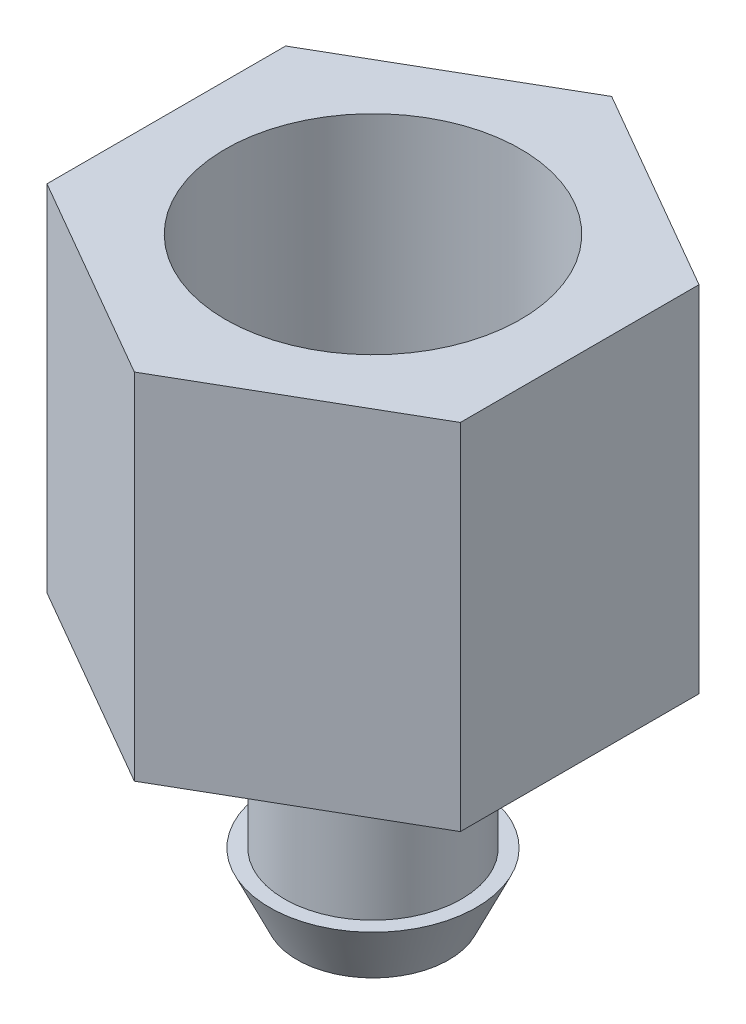
ISO-10303-21;
HEADER;
FILE_DESCRIPTION(('STEP AP214'),'2;1');
FILE_NAME('part.step','',(''),(''),'','','');
FILE_SCHEMA(('AUTOMOTIVE_DESIGN { 1 0 10303 214 1 1 1 1 }'));
ENDSEC;
DATA;
#1=APPLICATION_CONTEXT('core data for automotive mechanical design processes');
#2=APPLICATION_PROTOCOL_DEFINITION('international standard','automotive_design',2000,#1);
#3=PRODUCT_CONTEXT('',#1,'mechanical');
#4=PRODUCT('Part','Part','',(#3));
#5=PRODUCT_RELATED_PRODUCT_CATEGORY('part','',(#4));
#6=PRODUCT_DEFINITION_FORMATION('','',#4);
#7=PRODUCT_DEFINITION_CONTEXT('part definition',#1,'design');
#8=PRODUCT_DEFINITION('design','',#6,#7);
#9=PRODUCT_DEFINITION_SHAPE('','',#8);
#10=(LENGTH_UNIT() NAMED_UNIT(*) SI_UNIT(.MILLI.,.METRE.));
#11=(NAMED_UNIT(*) PLANE_ANGLE_UNIT() SI_UNIT($,.RADIAN.));
#12=(NAMED_UNIT(*) SI_UNIT($,.STERADIAN.) SOLID_ANGLE_UNIT());
#13=UNCERTAINTY_MEASURE_WITH_UNIT(LENGTH_MEASURE(1.E-05),#10,'distance_accuracy_value','');
#14=(GEOMETRIC_REPRESENTATION_CONTEXT(3) GLOBAL_UNCERTAINTY_ASSIGNED_CONTEXT((#13)) GLOBAL_UNIT_ASSIGNED_CONTEXT((#10,
#11,#12)) REPRESENTATION_CONTEXT('',''));
#15=CARTESIAN_POINT('',(0.,0.,0.));
#16=DIRECTION('',(0.,0.,1.));
#17=DIRECTION('',(1.,0.,0.));
#18=AXIS2_PLACEMENT_3D('',#15,#16,#17);
#19=CARTESIAN_POINT('',(0.,0.,-8.08290376865475));
#20=DIRECTION('',(0.,1.,0.));
#21=DIRECTION('',(0.,0.,1.));
#22=AXIS2_PLACEMENT_3D('',#19,#20,#21);
#23=PLANE('',#22);
#24=DIRECTION('',(-0.866025403784439,0.,-0.5));
#25=VECTOR('',#24,1.);
#26=CARTESIAN_POINT('',(6.99999999999998,0.,-4.04145188432738));
#27=LINE('',#26,#25);
#28=CARTESIAN_POINT('',(6.99999999999998,0.,-4.04145188432738));
#29=VERTEX_POINT('',#28);
#30=CARTESIAN_POINT('',(0.,0.,-8.08290376865475));
#31=VERTEX_POINT('',#30);
#32=EDGE_CURVE('E117',#29,#31,#27,.T.);
#33=ORIENTED_EDGE('',*,*,#32,.F.);
#34=DIRECTION('',(0.,0.,-1.));
#35=VECTOR('',#34,1.);
#36=CARTESIAN_POINT('',(6.99999999999998,0.,4.04145188432741));
#37=LINE('',#36,#35);
#38=CARTESIAN_POINT('',(6.99999999999998,0.,4.04145188432741));
#39=VERTEX_POINT('',#38);
#40=EDGE_CURVE('E77',#39,#29,#37,.T.);
#41=ORIENTED_EDGE('',*,*,#40,.F.);
#42=DIRECTION('',(0.866025403784439,0.,-0.5));
#43=VECTOR('',#42,1.);
#44=CARTESIAN_POINT('',(0.,0.,8.08290376865478));
#45=LINE('',#44,#43);
#46=CARTESIAN_POINT('',(0.,0.,8.08290376865478));
#47=VERTEX_POINT('',#46);
#48=EDGE_CURVE('E71',#47,#39,#45,.T.);
#49=ORIENTED_EDGE('',*,*,#48,.F.);
#50=DIRECTION('',(0.866025403784439,0.,0.5));
#51=VECTOR('',#50,1.);
#52=CARTESIAN_POINT('',(-7.00000000000001,0.,4.0414518843274));
#53=LINE('',#52,#51);
#54=CARTESIAN_POINT('',(-7.00000000000001,0.,4.0414518843274));
#55=VERTEX_POINT('',#54);
#56=EDGE_CURVE('E107',#55,#47,#53,.T.);
#57=ORIENTED_EDGE('',*,*,#56,.F.);
#58=DIRECTION('',(0.,0.,1.));
#59=VECTOR('',#58,1.);
#60=CARTESIAN_POINT('',(-7.00000000000001,0.,-4.04145188432736));
#61=LINE('',#60,#59);
#62=CARTESIAN_POINT('',(-7.00000000000001,0.,-4.04145188432736));
#63=VERTEX_POINT('',#62);
#64=EDGE_CURVE('E123',#63,#55,#61,.T.);
#65=ORIENTED_EDGE('',*,*,#64,.F.);
#66=DIRECTION('',(-0.866025403784439,0.,0.5));
#67=VECTOR('',#66,1.);
#68=CARTESIAN_POINT('',(0.,0.,-8.08290376865475));
#69=LINE('',#68,#67);
#70=EDGE_CURVE('E120',#31,#63,#69,.T.);
#71=ORIENTED_EDGE('',*,*,#70,.F.);
#72=EDGE_LOOP('',(#33,#41,#49,#57,#65,#71));
#73=FACE_BOUND('',#72,.T.);
#74=CARTESIAN_POINT('',(0.,0.,0.));
#75=DIRECTION('',(0.,1.,0.));
#76=DIRECTION('',(0.,0.,1.));
#77=AXIS2_PLACEMENT_3D('',#74,#75,#76);
#78=CIRCLE('',#77,3.);
#79=CARTESIAN_POINT('',(0.,0.,3.));
#80=VERTEX_POINT('',#79);
#81=EDGE_CURVE('E40',#80,#80,#78,.F.);
#82=ORIENTED_EDGE('',*,*,#81,.F.);
#83=EDGE_LOOP('',(#82));
#84=FACE_BOUND('',#83,.T.);
#85=ADVANCED_FACE('F31',(#73,#84),#23,.F.);
#86=CARTESIAN_POINT('',(6.99999999999998,12.,-4.04145188432738));
#87=DIRECTION('',(-0.5,0.,0.866025403784439));
#88=DIRECTION('',(0.866025403784439,0.,0.5));
#89=AXIS2_PLACEMENT_3D('',#86,#87,#88);
#90=PLANE('',#89);
#91=ORIENTED_EDGE('',*,*,#32,.T.);
#92=DIRECTION('',(0.,-1.,0.));
#93=VECTOR('',#92,1.);
#94=CARTESIAN_POINT('',(0.,12.,-8.08290376865475));
#95=LINE('',#94,#93);
#96=CARTESIAN_POINT('',(0.,12.,-8.08290376865475));
#97=VERTEX_POINT('',#96);
#98=EDGE_CURVE('E135',#97,#31,#95,.T.);
#99=ORIENTED_EDGE('',*,*,#98,.F.);
#100=DIRECTION('',(-0.866025403784439,0.,-0.5));
#101=VECTOR('',#100,1.);
#102=CARTESIAN_POINT('',(6.99999999999998,12.,-4.04145188432738));
#103=LINE('',#102,#101);
#104=CARTESIAN_POINT('',(6.99999999999998,12.,-4.04145188432738));
#105=VERTEX_POINT('',#104);
#106=EDGE_CURVE('E128',#105,#97,#103,.T.);
#107=ORIENTED_EDGE('',*,*,#106,.F.);
#108=DIRECTION('',(0.,-1.,0.));
#109=VECTOR('',#108,1.);
#110=CARTESIAN_POINT('',(6.99999999999998,12.,-4.04145188432738));
#111=LINE('',#110,#109);
#112=EDGE_CURVE('E113',#105,#29,#111,.T.);
#113=ORIENTED_EDGE('',*,*,#112,.T.);
#114=EDGE_LOOP('',(#91,#99,#107,#113));
#115=FACE_BOUND('',#114,.T.);
#116=ADVANCED_FACE('F142',(#115),#90,.F.);
#117=CARTESIAN_POINT('',(0.,12.,-8.08290376865475));
#118=DIRECTION('',(0.5,0.,0.866025403784439));
#119=DIRECTION('',(0.866025403784439,0.,-0.5));
#120=AXIS2_PLACEMENT_3D('',#117,#118,#119);
#121=PLANE('',#120);
#122=ORIENTED_EDGE('',*,*,#70,.T.);
#123=DIRECTION('',(0.,-1.,0.));
#124=VECTOR('',#123,1.);
#125=CARTESIAN_POINT('',(-7.00000000000001,12.,-4.04145188432736));
#126=LINE('',#125,#124);
#127=CARTESIAN_POINT('',(-7.00000000000001,12.,-4.04145188432736));
#128=VERTEX_POINT('',#127);
#129=EDGE_CURVE('E132',#128,#63,#126,.T.);
#130=ORIENTED_EDGE('',*,*,#129,.F.);
#131=DIRECTION('',(-0.866025403784439,0.,0.5));
#132=VECTOR('',#131,1.);
#133=CARTESIAN_POINT('',(0.,12.,-8.08290376865475));
#134=LINE('',#133,#132);
#135=EDGE_CURVE('E86',#97,#128,#134,.T.);
#136=ORIENTED_EDGE('',*,*,#135,.F.);
#137=ORIENTED_EDGE('',*,*,#98,.T.);
#138=EDGE_LOOP('',(#122,#130,#136,#137));
#139=FACE_BOUND('',#138,.T.);
#140=ADVANCED_FACE('F148',(#139),#121,.F.);
#141=CARTESIAN_POINT('',(-7.00000000000001,12.,-4.04145188432736));
#142=DIRECTION('',(1.,0.,0.));
#143=DIRECTION('',(0.,0.,-1.));
#144=AXIS2_PLACEMENT_3D('',#141,#142,#143);
#145=PLANE('',#144);
#146=ORIENTED_EDGE('',*,*,#64,.T.);
#147=DIRECTION('',(0.,-1.,0.));
#148=VECTOR('',#147,1.);
#149=CARTESIAN_POINT('',(-7.00000000000001,12.,4.0414518843274));
#150=LINE('',#149,#148);
#151=CARTESIAN_POINT('',(-7.00000000000001,12.,4.0414518843274));
#152=VERTEX_POINT('',#151);
#153=EDGE_CURVE('E108',#152,#55,#150,.T.);
#154=ORIENTED_EDGE('',*,*,#153,.F.);
#155=DIRECTION('',(0.,0.,1.));
#156=VECTOR('',#155,1.);
#157=CARTESIAN_POINT('',(-7.00000000000001,12.,-4.04145188432736));
#158=LINE('',#157,#156);
#159=EDGE_CURVE('E99',#128,#152,#158,.T.);
#160=ORIENTED_EDGE('',*,*,#159,.F.);
#161=ORIENTED_EDGE('',*,*,#129,.T.);
#162=EDGE_LOOP('',(#146,#154,#160,#161));
#163=FACE_BOUND('',#162,.T.);
#164=ADVANCED_FACE('F161',(#163),#145,.F.);
#165=CARTESIAN_POINT('',(-7.00000000000001,12.,4.0414518843274));
#166=DIRECTION('',(0.5,0.,-0.866025403784439));
#167=DIRECTION('',(-0.866025403784439,0.,-0.5));
#168=AXIS2_PLACEMENT_3D('',#165,#166,#167);
#169=PLANE('',#168);
#170=ORIENTED_EDGE('',*,*,#56,.T.);
#171=DIRECTION('',(0.,-1.,0.));
#172=VECTOR('',#171,1.);
#173=CARTESIAN_POINT('',(0.,12.,8.08290376865478));
#174=LINE('',#173,#172);
#175=CARTESIAN_POINT('',(0.,12.,8.08290376865478));
#176=VERTEX_POINT('',#175);
#177=EDGE_CURVE('E104',#176,#47,#174,.T.);
#178=ORIENTED_EDGE('',*,*,#177,.F.);
#179=DIRECTION('',(0.866025403784439,0.,0.5));
#180=VECTOR('',#179,1.);
#181=CARTESIAN_POINT('',(-7.00000000000001,12.,4.0414518843274));
#182=LINE('',#181,#180);
#183=EDGE_CURVE('E93',#152,#176,#182,.T.);
#184=ORIENTED_EDGE('',*,*,#183,.F.);
#185=ORIENTED_EDGE('',*,*,#153,.T.);
#186=EDGE_LOOP('',(#170,#178,#184,#185));
#187=FACE_BOUND('',#186,.T.);
#188=ADVANCED_FACE('F105',(#187),#169,.F.);
#189=CARTESIAN_POINT('',(0.,12.,8.08290376865478));
#190=DIRECTION('',(-0.5,0.,-0.866025403784439));
#191=DIRECTION('',(-0.866025403784439,0.,0.5));
#192=AXIS2_PLACEMENT_3D('',#189,#190,#191);
#193=PLANE('',#192);
#194=ORIENTED_EDGE('',*,*,#48,.T.);
#195=DIRECTION('',(0.,-1.,0.));
#196=VECTOR('',#195,1.);
#197=CARTESIAN_POINT('',(6.99999999999998,12.,4.04145188432741));
#198=LINE('',#197,#196);
#199=CARTESIAN_POINT('',(6.99999999999998,12.,4.04145188432741));
#200=VERTEX_POINT('',#199);
#201=EDGE_CURVE('E109',#200,#39,#198,.T.);
#202=ORIENTED_EDGE('',*,*,#201,.F.);
#203=DIRECTION('',(0.866025403784439,0.,-0.5));
#204=VECTOR('',#203,1.);
#205=CARTESIAN_POINT('',(0.,12.,8.08290376865478));
#206=LINE('',#205,#204);
#207=EDGE_CURVE('E97',#176,#200,#206,.T.);
#208=ORIENTED_EDGE('',*,*,#207,.F.);
#209=ORIENTED_EDGE('',*,*,#177,.T.);
#210=EDGE_LOOP('',(#194,#202,#208,#209));
#211=FACE_BOUND('',#210,.T.);
#212=ADVANCED_FACE('F111',(#211),#193,.F.);
#213=CARTESIAN_POINT('',(6.99999999999998,12.,4.04145188432741));
#214=DIRECTION('',(-1.,0.,0.));
#215=DIRECTION('',(0.,0.,1.));
#216=AXIS2_PLACEMENT_3D('',#213,#214,#215);
#217=PLANE('',#216);
#218=ORIENTED_EDGE('',*,*,#40,.T.);
#219=ORIENTED_EDGE('',*,*,#112,.F.);
#220=DIRECTION('',(0.,0.,-1.));
#221=VECTOR('',#220,1.);
#222=CARTESIAN_POINT('',(6.99999999999998,12.,4.04145188432741));
#223=LINE('',#222,#221);
#224=EDGE_CURVE('E48',#200,#105,#223,.T.);
#225=ORIENTED_EDGE('',*,*,#224,.F.);
#226=ORIENTED_EDGE('',*,*,#201,.T.);
#227=EDGE_LOOP('',(#218,#219,#225,#226));
#228=FACE_BOUND('',#227,.T.);
#229=ADVANCED_FACE('F154',(#228),#217,.F.);
#230=CARTESIAN_POINT('',(0.,12.,-8.08290376865475));
#231=DIRECTION('',(0.,1.,0.));
#232=DIRECTION('',(0.,0.,1.));
#233=AXIS2_PLACEMENT_3D('',#230,#231,#232);
#234=PLANE('',#233);
#235=CARTESIAN_POINT('',(0.,12.,0.));
#236=DIRECTION('',(0.,1.,0.));
#237=DIRECTION('',(0.,0.,1.));
#238=AXIS2_PLACEMENT_3D('',#235,#236,#237);
#239=CIRCLE('',#238,5.);
#240=CARTESIAN_POINT('',(0.,12.,5.));
#241=VERTEX_POINT('',#240);
#242=EDGE_CURVE('E174',#241,#241,#239,.T.);
#243=ORIENTED_EDGE('',*,*,#242,.F.);
#244=EDGE_LOOP('',(#243));
#245=FACE_BOUND('',#244,.T.);
#246=ORIENTED_EDGE('',*,*,#106,.T.);
#247=ORIENTED_EDGE('',*,*,#135,.T.);
#248=ORIENTED_EDGE('',*,*,#159,.T.);
#249=ORIENTED_EDGE('',*,*,#183,.T.);
#250=ORIENTED_EDGE('',*,*,#207,.T.);
#251=ORIENTED_EDGE('',*,*,#224,.T.);
#252=EDGE_LOOP('',(#246,#247,#248,#249,#250,#251));
#253=FACE_BOUND('',#252,.T.);
#254=ADVANCED_FACE('F95',(#245,#253),#234,.T.);
#255=CARTESIAN_POINT('',(0.,2.,0.));
#256=DIRECTION('',(0.,1.,0.));
#257=DIRECTION('',(0.,0.,1.));
#258=AXIS2_PLACEMENT_3D('',#255,#256,#257);
#259=CYLINDRICAL_SURFACE('',#258,5.);
#260=CARTESIAN_POINT('',(0.,2.,0.));
#261=DIRECTION('',(0.,1.,0.));
#262=DIRECTION('',(0.,0.,1.));
#263=AXIS2_PLACEMENT_3D('',#260,#261,#262);
#264=CIRCLE('',#263,5.);
#265=CARTESIAN_POINT('',(0.,2.,5.));
#266=VERTEX_POINT('',#265);
#267=EDGE_CURVE('E121',#266,#266,#264,.T.);
#268=ORIENTED_EDGE('',*,*,#267,.F.);
#269=EDGE_LOOP('',(#268));
#270=FACE_BOUND('',#269,.T.);
#271=ORIENTED_EDGE('',*,*,#242,.T.);
#272=EDGE_LOOP('',(#271));
#273=FACE_BOUND('',#272,.T.);
#274=ADVANCED_FACE('F213',(#270,#273),#259,.F.);
#275=CARTESIAN_POINT('',(0.,2.,0.));
#276=DIRECTION('',(0.,1.,0.));
#277=DIRECTION('',(0.,0.,1.));
#278=AXIS2_PLACEMENT_3D('',#275,#276,#277);
#279=PLANE('',#278);
#280=CARTESIAN_POINT('',(0.,2.,0.));
#281=DIRECTION('',(0.,1.,0.));
#282=DIRECTION('',(0.,0.,1.));
#283=AXIS2_PLACEMENT_3D('',#280,#281,#282);
#284=CIRCLE('',#283,1.75);
#285=CARTESIAN_POINT('',(0.,2.,1.75));
#286=VERTEX_POINT('',#285);
#287=EDGE_CURVE('E186',#286,#286,#284,.F.);
#288=ORIENTED_EDGE('',*,*,#287,.T.);
#289=EDGE_LOOP('',(#288));
#290=FACE_BOUND('',#289,.T.);
#291=ORIENTED_EDGE('',*,*,#267,.T.);
#292=EDGE_LOOP('',(#291));
#293=FACE_BOUND('',#292,.T.);
#294=ADVANCED_FACE('F210',(#290,#293),#279,.T.);
#295=CARTESIAN_POINT('',(0.,-6.,0.));
#296=DIRECTION('',(0.,1.,0.));
#297=DIRECTION('',(0.,0.,1.));
#298=AXIS2_PLACEMENT_3D('',#295,#296,#297);
#299=CYLINDRICAL_SURFACE('',#298,3.);
#300=CARTESIAN_POINT('',(0.,-6.,0.));
#301=DIRECTION('',(0.,-1.,0.));
#302=DIRECTION('',(0.,0.,-1.));
#303=AXIS2_PLACEMENT_3D('',#300,#301,#302);
#304=CIRCLE('',#303,3.);
#305=CARTESIAN_POINT('',(0.,-6.,-3.));
#306=VERTEX_POINT('',#305);
#307=EDGE_CURVE('E177',#306,#306,#304,.T.);
#308=ORIENTED_EDGE('',*,*,#307,.F.);
#309=EDGE_LOOP('',(#308));
#310=FACE_BOUND('',#309,.T.);
#311=ORIENTED_EDGE('',*,*,#81,.T.);
#312=EDGE_LOOP('',(#311));
#313=FACE_BOUND('',#312,.T.);
#314=ADVANCED_FACE('F139',(#310,#313),#299,.T.);
#315=CARTESIAN_POINT('',(0.,-6.,0.));
#316=DIRECTION('',(0.,-1.,0.));
#317=DIRECTION('',(0.,0.,-1.));
#318=AXIS2_PLACEMENT_3D('',#315,#316,#317);
#319=PLANE('',#318);
#320=CARTESIAN_POINT('',(0.,-6.,0.));
#321=DIRECTION('',(0.,-1.,0.));
#322=DIRECTION('',(0.,0.,-1.));
#323=AXIS2_PLACEMENT_3D('',#320,#321,#322);
#324=CIRCLE('',#323,3.5);
#325=CARTESIAN_POINT('',(0.,-6.,-3.5));
#326=VERTEX_POINT('',#325);
#327=EDGE_CURVE('E182',#326,#326,#324,.T.);
#328=ORIENTED_EDGE('',*,*,#327,.F.);
#329=EDGE_LOOP('',(#328));
#330=FACE_BOUND('',#329,.T.);
#331=ORIENTED_EDGE('',*,*,#307,.T.);
#332=EDGE_LOOP('',(#331));
#333=FACE_BOUND('',#332,.T.);
#334=ADVANCED_FACE('F196',(#330,#333),#319,.F.);
#335=CARTESIAN_POINT('',(0.,-8.,0.));
#336=DIRECTION('',(0.,-1.,0.));
#337=DIRECTION('',(0.,0.,-1.));
#338=AXIS2_PLACEMENT_3D('',#335,#336,#337);
#339=PLANE('',#338);
#340=CARTESIAN_POINT('',(0.,-8.,0.));
#341=DIRECTION('',(0.,-1.,0.));
#342=DIRECTION('',(0.,0.,-1.));
#343=AXIS2_PLACEMENT_3D('',#340,#341,#342);
#344=CIRCLE('',#343,2.56738468369);
#345=CARTESIAN_POINT('',(0.,-8.,-2.56738468369));
#346=VERTEX_POINT('',#345);
#347=EDGE_CURVE('E11',#346,#346,#344,.T.);
#348=ORIENTED_EDGE('',*,*,#347,.T.);
#349=EDGE_LOOP('',(#348));
#350=FACE_BOUND('',#349,.T.);
#351=CARTESIAN_POINT('',(0.,-8.,0.));
#352=DIRECTION('',(0.,-1.,0.));
#353=DIRECTION('',(0.,0.,-1.));
#354=AXIS2_PLACEMENT_3D('',#351,#352,#353);
#355=CIRCLE('',#354,1.75);
#356=CARTESIAN_POINT('',(0.,-8.,-1.75));
#357=VERTEX_POINT('',#356);
#358=EDGE_CURVE('E185',#357,#357,#355,.T.);
#359=ORIENTED_EDGE('',*,*,#358,.F.);
#360=EDGE_LOOP('',(#359));
#361=FACE_BOUND('',#360,.T.);
#362=ADVANCED_FACE('F194',(#350,#361),#339,.T.);
#363=CARTESIAN_POINT('',(0.,12.001,0.));
#364=DIRECTION('',(0.,-1.,0.));
#365=DIRECTION('',(0.,0.,-1.));
#366=AXIS2_PLACEMENT_3D('',#363,#364,#365);
#367=CYLINDRICAL_SURFACE('',#366,1.75);
#368=ORIENTED_EDGE('',*,*,#287,.F.);
#369=EDGE_LOOP('',(#368));
#370=FACE_BOUND('',#369,.T.);
#371=ORIENTED_EDGE('',*,*,#358,.T.);
#372=EDGE_LOOP('',(#371));
#373=FACE_BOUND('',#372,.T.);
#374=ADVANCED_FACE('F192',(#370,#373),#367,.F.);
#375=CARTESIAN_POINT('',(0.,-8.,0.));
#376=DIRECTION('',(0.,1.,0.));
#377=DIRECTION('',(0.,0.,1.));
#378=AXIS2_PLACEMENT_3D('',#375,#376,#377);
#379=CONICAL_SURFACE('',#378,2.56738468369,0.436332312998581);
#380=ORIENTED_EDGE('',*,*,#327,.T.);
#381=EDGE_LOOP('',(#380));
#382=FACE_BOUND('',#381,.T.);
#383=ORIENTED_EDGE('',*,*,#347,.F.);
#384=EDGE_LOOP('',(#383));
#385=FACE_BOUND('',#384,.T.);
#386=ADVANCED_FACE('F33',(#382,#385),#379,.T.);
#387=CLOSED_SHELL('',(#85,#116,#140,#164,#188,#212,#229,#254,#274,#294,#314,#334,#362,#374,#386));
#388=MANIFOLD_SOLID_BREP('B2',#387);
#389=ADVANCED_BREP_SHAPE_REPRESENTATION('',(#18,#388),#14);
#390=SHAPE_DEFINITION_REPRESENTATION(#9,#389);
ENDSEC;
END-ISO-10303-21;
